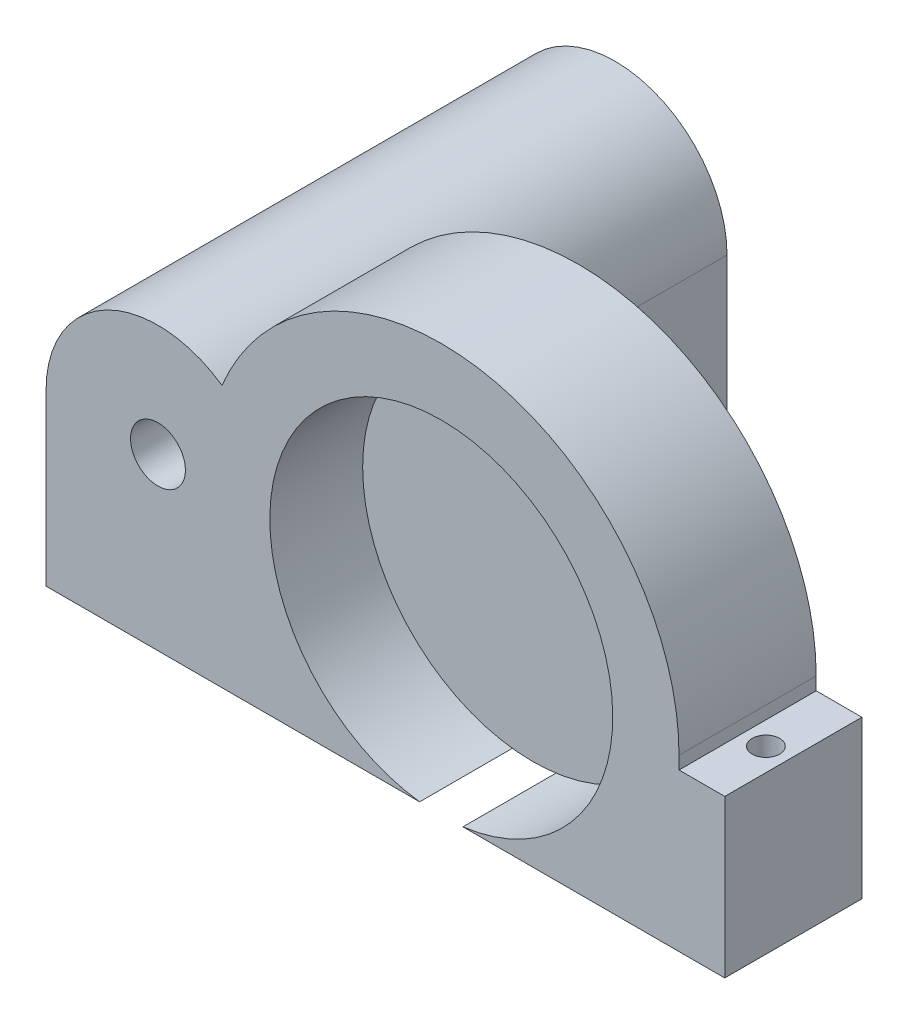
ISO-10303-21;
HEADER;
FILE_DESCRIPTION(('STEP AP214'),'2;1');
FILE_NAME('part.step','',(''),(''),'','','');
FILE_SCHEMA(('AUTOMOTIVE_DESIGN { 1 0 10303 214 1 1 1 1 }'));
ENDSEC;
DATA;
#1=APPLICATION_CONTEXT('core data for automotive mechanical design processes');
#2=APPLICATION_PROTOCOL_DEFINITION('international standard','automotive_design',2000,#1);
#3=PRODUCT_CONTEXT('',#1,'mechanical');
#4=PRODUCT('Part','Part','',(#3));
#5=PRODUCT_RELATED_PRODUCT_CATEGORY('part','',(#4));
#6=PRODUCT_DEFINITION_FORMATION('','',#4);
#7=PRODUCT_DEFINITION_CONTEXT('part definition',#1,'design');
#8=PRODUCT_DEFINITION('design','',#6,#7);
#9=PRODUCT_DEFINITION_SHAPE('','',#8);
#10=(LENGTH_UNIT() NAMED_UNIT(*) SI_UNIT(.MILLI.,.METRE.));
#11=(NAMED_UNIT(*) PLANE_ANGLE_UNIT() SI_UNIT($,.RADIAN.));
#12=(NAMED_UNIT(*) SI_UNIT($,.STERADIAN.) SOLID_ANGLE_UNIT());
#13=UNCERTAINTY_MEASURE_WITH_UNIT(LENGTH_MEASURE(1.E-05),#10,'distance_accuracy_value','');
#14=(GEOMETRIC_REPRESENTATION_CONTEXT(3) GLOBAL_UNCERTAINTY_ASSIGNED_CONTEXT((#13)) GLOBAL_UNIT_ASSIGNED_CONTEXT((#10,
#11,#12)) REPRESENTATION_CONTEXT('',''));
#15=CARTESIAN_POINT('',(0.,0.,0.));
#16=DIRECTION('',(0.,0.,1.));
#17=DIRECTION('',(1.,0.,0.));
#18=AXIS2_PLACEMENT_3D('',#15,#16,#17);
#19=CARTESIAN_POINT('',(0.,0.,0.));
#20=DIRECTION('',(0.,0.,1.));
#21=DIRECTION('',(1.,0.,0.));
#22=AXIS2_PLACEMENT_3D('',#19,#20,#21);
#23=PLANE('',#22);
#24=CARTESIAN_POINT('',(0.,0.,0.));
#25=DIRECTION('',(0.,0.,1.));
#26=DIRECTION('',(1.,0.,0.));
#27=AXIS2_PLACEMENT_3D('',#24,#25,#26);
#28=CIRCLE('',#27,18.75);
#29=CARTESIAN_POINT('',(2.36696007570894,-18.6,0.));
#30=VERTEX_POINT('',#29);
#31=CARTESIAN_POINT('',(-18.75,0.,0.));
#32=VERTEX_POINT('',#31);
#33=EDGE_CURVE('E156',#30,#32,#28,.T.);
#34=ORIENTED_EDGE('',*,*,#33,.T.);
#35=CARTESIAN_POINT('',(-30.9847959940793,0.,0.));
#36=DIRECTION('',(0.,0.,1.));
#37=DIRECTION('',(1.,0.,0.));
#38=AXIS2_PLACEMENT_3D('',#35,#36,#37);
#39=CIRCLE('',#38,12.2347959940793);
#40=CARTESIAN_POINT('',(-23.9854306296223,10.0348949925536,0.));
#41=VERTEX_POINT('',#40);
#42=EDGE_CURVE('E12',#32,#41,#39,.T.);
#43=ORIENTED_EDGE('',*,*,#42,.T.);
#44=CARTESIAN_POINT('',(0.,0.,0.));
#45=DIRECTION('',(0.,0.,1.));
#46=DIRECTION('',(1.,0.,0.));
#47=AXIS2_PLACEMENT_3D('',#44,#45,#46);
#48=CIRCLE('',#47,26.);
#49=CARTESIAN_POINT('',(26.,0.,0.));
#50=VERTEX_POINT('',#49);
#51=EDGE_CURVE('E99',#41,#50,#48,.F.);
#52=ORIENTED_EDGE('',*,*,#51,.T.);
#53=DIRECTION('',(0.,-1.,0.));
#54=VECTOR('',#53,1.);
#55=CARTESIAN_POINT('',(26.,0.,0.));
#56=LINE('',#55,#54);
#57=CARTESIAN_POINT('',(26.,-1.40113329018293,0.));
#58=VERTEX_POINT('',#57);
#59=EDGE_CURVE('E162',#50,#58,#56,.T.);
#60=ORIENTED_EDGE('',*,*,#59,.T.);
#61=DIRECTION('',(1.,0.,0.));
#62=VECTOR('',#61,1.);
#63=CARTESIAN_POINT('',(0.,-1.40113329018292,0.));
#64=LINE('',#63,#62);
#65=CARTESIAN_POINT('',(31.,-1.40113329018293,0.));
#66=VERTEX_POINT('',#65);
#67=EDGE_CURVE('E160',#58,#66,#64,.T.);
#68=ORIENTED_EDGE('',*,*,#67,.T.);
#69=DIRECTION('',(0.,-1.,0.));
#70=VECTOR('',#69,1.);
#71=CARTESIAN_POINT('',(31.,0.,0.));
#72=LINE('',#71,#70);
#73=CARTESIAN_POINT('',(31.,-18.6,0.));
#74=VERTEX_POINT('',#73);
#75=EDGE_CURVE('E125',#66,#74,#72,.T.);
#76=ORIENTED_EDGE('',*,*,#75,.T.);
#77=DIRECTION('',(1.,0.,0.));
#78=VECTOR('',#77,1.);
#79=CARTESIAN_POINT('',(0.,-18.6,0.));
#80=LINE('',#79,#78);
#81=EDGE_CURVE('E155',#30,#74,#80,.T.);
#82=ORIENTED_EDGE('',*,*,#81,.F.);
#83=EDGE_LOOP('',(#34,#43,#52,#60,#68,#76,#82));
#84=FACE_BOUND('',#83,.T.);
#85=ADVANCED_FACE('F47',(#84),#23,.F.);
#86=CARTESIAN_POINT('',(0.,0.,15.));
#87=DIRECTION('',(0.,0.,-1.));
#88=DIRECTION('',(-1.,0.,0.));
#89=AXIS2_PLACEMENT_3D('',#86,#87,#88);
#90=CYLINDRICAL_SURFACE('',#89,26.);
#91=DIRECTION('',(0.,0.,-1.));
#92=VECTOR('',#91,1.);
#93=CARTESIAN_POINT('',(-23.9854306296223,10.0348949925536,-10.));
#94=LINE('',#93,#92);
#95=CARTESIAN_POINT('',(-23.9854306296223,10.0348949925536,15.));
#96=VERTEX_POINT('',#95);
#97=EDGE_CURVE('E174',#96,#41,#94,.T.);
#98=ORIENTED_EDGE('',*,*,#97,.F.);
#99=CARTESIAN_POINT('',(0.,0.,15.));
#100=DIRECTION('',(0.,0.,1.));
#101=DIRECTION('',(1.,0.,0.));
#102=AXIS2_PLACEMENT_3D('',#99,#100,#101);
#103=CIRCLE('',#102,26.);
#104=CARTESIAN_POINT('',(26.,0.,15.));
#105=VERTEX_POINT('',#104);
#106=EDGE_CURVE('E71',#96,#105,#103,.F.);
#107=ORIENTED_EDGE('',*,*,#106,.T.);
#108=DIRECTION('',(0.,0.,-1.));
#109=VECTOR('',#108,1.);
#110=CARTESIAN_POINT('',(26.,0.,15.));
#111=LINE('',#110,#109);
#112=EDGE_CURVE('E146',#105,#50,#111,.T.);
#113=ORIENTED_EDGE('',*,*,#112,.T.);
#114=ORIENTED_EDGE('',*,*,#51,.F.);
#115=EDGE_LOOP('',(#98,#107,#113,#114));
#116=FACE_BOUND('',#115,.T.);
#117=ADVANCED_FACE('F49',(#116),#90,.T.);
#118=CARTESIAN_POINT('',(0.,-18.6,15.));
#119=DIRECTION('',(0.,1.,0.));
#120=DIRECTION('',(0.,0.,1.));
#121=AXIS2_PLACEMENT_3D('',#118,#119,#120);
#122=PLANE('',#121);
#123=DIRECTION('',(0.,0.,-1.));
#124=VECTOR('',#123,1.);
#125=CARTESIAN_POINT('',(-2.36696007570894,-18.6,15.));
#126=LINE('',#125,#124);
#127=CARTESIAN_POINT('',(-2.36696007570894,-18.6,15.));
#128=VERTEX_POINT('',#127);
#129=CARTESIAN_POINT('',(-2.36696007570894,-18.6,0.));
#130=VERTEX_POINT('',#129);
#131=EDGE_CURVE('E169',#128,#130,#126,.T.);
#132=ORIENTED_EDGE('',*,*,#131,.F.);
#133=DIRECTION('',(1.,0.,0.));
#134=VECTOR('',#133,1.);
#135=CARTESIAN_POINT('',(0.,-18.6,15.));
#136=LINE('',#135,#134);
#137=CARTESIAN_POINT('',(-43.2195919881586,-18.6,15.));
#138=VERTEX_POINT('',#137);
#139=EDGE_CURVE('E107',#138,#128,#136,.T.);
#140=ORIENTED_EDGE('',*,*,#139,.F.);
#141=DIRECTION('',(0.,0.,-1.));
#142=VECTOR('',#141,1.);
#143=CARTESIAN_POINT('',(-43.2195919881586,-18.6,15.));
#144=LINE('',#143,#142);
#145=CARTESIAN_POINT('',(-43.2195919881586,-18.6,-35.));
#146=VERTEX_POINT('',#145);
#147=EDGE_CURVE('E205',#138,#146,#144,.T.);
#148=ORIENTED_EDGE('',*,*,#147,.T.);
#149=DIRECTION('',(1.,0.,0.));
#150=VECTOR('',#149,1.);
#151=CARTESIAN_POINT('',(0.,-18.6,-35.));
#152=LINE('',#151,#150);
#153=CARTESIAN_POINT('',(-18.75,-18.6,-35.));
#154=VERTEX_POINT('',#153);
#155=EDGE_CURVE('E201',#146,#154,#152,.T.);
#156=ORIENTED_EDGE('',*,*,#155,.T.);
#157=DIRECTION('',(0.,0.,-1.));
#158=VECTOR('',#157,1.);
#159=CARTESIAN_POINT('',(-18.75,-18.6,15.));
#160=LINE('',#159,#158);
#161=CARTESIAN_POINT('',(-18.75,-18.6,0.));
#162=VERTEX_POINT('',#161);
#163=EDGE_CURVE('E198',#162,#154,#160,.T.);
#164=ORIENTED_EDGE('',*,*,#163,.F.);
#165=EDGE_CURVE('E151',#162,#130,#80,.T.);
#166=ORIENTED_EDGE('',*,*,#165,.T.);
#167=EDGE_LOOP('',(#132,#140,#148,#156,#164,#166));
#168=FACE_BOUND('',#167,.T.);
#169=ADVANCED_FACE('F194',(#168),#122,.F.);
#170=CARTESIAN_POINT('',(0.,0.,15.));
#171=DIRECTION('',(0.,0.,-1.));
#172=DIRECTION('',(-1.,0.,0.));
#173=AXIS2_PLACEMENT_3D('',#170,#171,#172);
#174=CYLINDRICAL_SURFACE('',#173,18.75);
#175=EDGE_CURVE('E154',#32,#130,#28,.T.);
#176=ORIENTED_EDGE('',*,*,#175,.F.);
#177=ORIENTED_EDGE('',*,*,#33,.F.);
#178=DIRECTION('',(0.,0.,-1.));
#179=VECTOR('',#178,1.);
#180=CARTESIAN_POINT('',(2.36696007570894,-18.6,15.));
#181=LINE('',#180,#179);
#182=CARTESIAN_POINT('',(2.36696007570894,-18.6,15.));
#183=VERTEX_POINT('',#182);
#184=EDGE_CURVE('E167',#183,#30,#181,.T.);
#185=ORIENTED_EDGE('',*,*,#184,.F.);
#186=CARTESIAN_POINT('',(0.,0.,15.));
#187=DIRECTION('',(0.,0.,1.));
#188=DIRECTION('',(1.,0.,0.));
#189=AXIS2_PLACEMENT_3D('',#186,#187,#188);
#190=CIRCLE('',#189,18.75);
#191=EDGE_CURVE('E192',#183,#128,#190,.T.);
#192=ORIENTED_EDGE('',*,*,#191,.T.);
#193=ORIENTED_EDGE('',*,*,#131,.T.);
#194=EDGE_LOOP('',(#176,#177,#185,#192,#193));
#195=FACE_BOUND('',#194,.T.);
#196=ADVANCED_FACE('F186',(#195),#174,.F.);
#197=CARTESIAN_POINT('',(28.5,-18.6,8.));
#198=DIRECTION('',(0.,1.,0.));
#199=DIRECTION('',(0.,0.,1.));
#200=AXIS2_PLACEMENT_3D('',#197,#198,#199);
#201=CIRCLE('',#200,1.5);
#202=CARTESIAN_POINT('',(28.5,-18.6,9.5));
#203=VERTEX_POINT('',#202);
#204=EDGE_CURVE('E152',#203,#203,#201,.T.);
#205=ORIENTED_EDGE('',*,*,#204,.T.);
#206=EDGE_LOOP('',(#205));
#207=FACE_BOUND('',#206,.T.);
#208=ORIENTED_EDGE('',*,*,#81,.T.);
#209=DIRECTION('',(0.,0.,-1.));
#210=VECTOR('',#209,1.);
#211=CARTESIAN_POINT('',(31.,-18.6,15.));
#212=LINE('',#211,#210);
#213=CARTESIAN_POINT('',(31.,-18.6,15.));
#214=VERTEX_POINT('',#213);
#215=EDGE_CURVE('E130',#214,#74,#212,.T.);
#216=ORIENTED_EDGE('',*,*,#215,.F.);
#217=EDGE_CURVE('E140',#183,#214,#136,.T.);
#218=ORIENTED_EDGE('',*,*,#217,.F.);
#219=ORIENTED_EDGE('',*,*,#184,.T.);
#220=EDGE_LOOP('',(#208,#216,#218,#219));
#221=FACE_BOUND('',#220,.T.);
#222=ADVANCED_FACE('F191',(#207,#221),#122,.F.);
#223=CARTESIAN_POINT('',(31.,0.,15.));
#224=DIRECTION('',(1.,0.,0.));
#225=DIRECTION('',(0.,1.,0.));
#226=AXIS2_PLACEMENT_3D('',#223,#224,#225);
#227=PLANE('',#226);
#228=ORIENTED_EDGE('',*,*,#75,.F.);
#229=DIRECTION('',(0.,0.,-1.));
#230=VECTOR('',#229,1.);
#231=CARTESIAN_POINT('',(31.,-1.40113329018293,15.));
#232=LINE('',#231,#230);
#233=CARTESIAN_POINT('',(31.,-1.40113329018293,15.));
#234=VERTEX_POINT('',#233);
#235=EDGE_CURVE('E120',#234,#66,#232,.T.);
#236=ORIENTED_EDGE('',*,*,#235,.F.);
#237=DIRECTION('',(0.,-1.,0.));
#238=VECTOR('',#237,1.);
#239=CARTESIAN_POINT('',(31.,0.,15.));
#240=LINE('',#239,#238);
#241=EDGE_CURVE('E123',#234,#214,#240,.T.);
#242=ORIENTED_EDGE('',*,*,#241,.T.);
#243=ORIENTED_EDGE('',*,*,#215,.T.);
#244=EDGE_LOOP('',(#228,#236,#242,#243));
#245=FACE_BOUND('',#244,.T.);
#246=ADVANCED_FACE('F122',(#245),#227,.T.);
#247=CARTESIAN_POINT('',(0.,-1.40113329018292,15.));
#248=DIRECTION('',(0.,1.,0.));
#249=DIRECTION('',(-1.,0.,0.));
#250=AXIS2_PLACEMENT_3D('',#247,#248,#249);
#251=PLANE('',#250);
#252=CARTESIAN_POINT('',(28.5,-1.40113329018293,8.));
#253=DIRECTION('',(0.,1.,0.));
#254=DIRECTION('',(-1.,0.,0.));
#255=AXIS2_PLACEMENT_3D('',#252,#253,#254);
#256=CIRCLE('',#255,1.5);
#257=CARTESIAN_POINT('',(27.,-1.40113329018293,8.));
#258=VERTEX_POINT('',#257);
#259=EDGE_CURVE('E172',#258,#258,#256,.T.);
#260=ORIENTED_EDGE('',*,*,#259,.F.);
#261=EDGE_LOOP('',(#260));
#262=FACE_BOUND('',#261,.T.);
#263=ORIENTED_EDGE('',*,*,#67,.F.);
#264=DIRECTION('',(0.,0.,-1.));
#265=VECTOR('',#264,1.);
#266=CARTESIAN_POINT('',(26.,-1.40113329018293,15.));
#267=LINE('',#266,#265);
#268=CARTESIAN_POINT('',(26.,-1.40113329018293,15.));
#269=VERTEX_POINT('',#268);
#270=EDGE_CURVE('E131',#269,#58,#267,.T.);
#271=ORIENTED_EDGE('',*,*,#270,.F.);
#272=DIRECTION('',(1.,0.,0.));
#273=VECTOR('',#272,1.);
#274=CARTESIAN_POINT('',(0.,-1.40113329018292,15.));
#275=LINE('',#274,#273);
#276=EDGE_CURVE('E137',#269,#234,#275,.T.);
#277=ORIENTED_EDGE('',*,*,#276,.T.);
#278=ORIENTED_EDGE('',*,*,#235,.T.);
#279=EDGE_LOOP('',(#263,#271,#277,#278));
#280=FACE_BOUND('',#279,.T.);
#281=ADVANCED_FACE('F143',(#262,#280),#251,.T.);
#282=CARTESIAN_POINT('',(26.,0.,15.));
#283=DIRECTION('',(1.,0.,0.));
#284=DIRECTION('',(0.,0.,-1.));
#285=AXIS2_PLACEMENT_3D('',#282,#283,#284);
#286=PLANE('',#285);
#287=ORIENTED_EDGE('',*,*,#59,.F.);
#288=ORIENTED_EDGE('',*,*,#112,.F.);
#289=DIRECTION('',(0.,-1.,0.));
#290=VECTOR('',#289,1.);
#291=CARTESIAN_POINT('',(26.,0.,15.));
#292=LINE('',#291,#290);
#293=EDGE_CURVE('E144',#105,#269,#292,.T.);
#294=ORIENTED_EDGE('',*,*,#293,.T.);
#295=ORIENTED_EDGE('',*,*,#270,.T.);
#296=EDGE_LOOP('',(#287,#288,#294,#295));
#297=FACE_BOUND('',#296,.T.);
#298=ADVANCED_FACE('F242',(#297),#286,.T.);
#299=CARTESIAN_POINT('',(0.,0.,15.));
#300=DIRECTION('',(0.,0.,1.));
#301=DIRECTION('',(1.,0.,0.));
#302=AXIS2_PLACEMENT_3D('',#299,#300,#301);
#303=PLANE('',#302);
#304=ORIENTED_EDGE('',*,*,#106,.F.);
#305=CARTESIAN_POINT('',(-30.9847959940793,0.,15.));
#306=DIRECTION('',(0.,0.,1.));
#307=DIRECTION('',(1.,0.,0.));
#308=AXIS2_PLACEMENT_3D('',#305,#306,#307);
#309=CIRCLE('',#308,12.2347959940793);
#310=CARTESIAN_POINT('',(-43.2195919881586,0.,15.));
#311=VERTEX_POINT('',#310);
#312=EDGE_CURVE('E367',#311,#96,#309,.F.);
#313=ORIENTED_EDGE('',*,*,#312,.F.);
#314=DIRECTION('',(0.,-1.,0.));
#315=VECTOR('',#314,1.);
#316=CARTESIAN_POINT('',(-43.2195919881586,0.,15.));
#317=LINE('',#316,#315);
#318=EDGE_CURVE('E370',#311,#138,#317,.T.);
#319=ORIENTED_EDGE('',*,*,#318,.T.);
#320=ORIENTED_EDGE('',*,*,#139,.T.);
#321=ORIENTED_EDGE('',*,*,#191,.F.);
#322=ORIENTED_EDGE('',*,*,#217,.T.);
#323=ORIENTED_EDGE('',*,*,#241,.F.);
#324=ORIENTED_EDGE('',*,*,#276,.F.);
#325=ORIENTED_EDGE('',*,*,#293,.F.);
#326=EDGE_LOOP('',(#304,#313,#319,#320,#321,#322,#323,#324,#325));
#327=FACE_BOUND('',#326,.T.);
#328=CARTESIAN_POINT('',(-30.9847959940793,0.,15.));
#329=DIRECTION('',(0.,0.,1.));
#330=DIRECTION('',(1.,0.,0.));
#331=AXIS2_PLACEMENT_3D('',#328,#329,#330);
#332=CIRCLE('',#331,3.);
#333=CARTESIAN_POINT('',(-27.9847959940793,0.,15.));
#334=VERTEX_POINT('',#333);
#335=EDGE_CURVE('E209',#334,#334,#332,.T.);
#336=ORIENTED_EDGE('',*,*,#335,.F.);
#337=EDGE_LOOP('',(#336));
#338=FACE_BOUND('',#337,.T.);
#339=ADVANCED_FACE('F134',(#327,#338),#303,.T.);
#340=ORIENTED_EDGE('',*,*,#165,.F.);
#341=DIRECTION('',(0.,1.,0.));
#342=VECTOR('',#341,1.);
#343=CARTESIAN_POINT('',(-18.75,0.,0.));
#344=LINE('',#343,#342);
#345=EDGE_CURVE('E55',#162,#32,#344,.T.);
#346=ORIENTED_EDGE('',*,*,#345,.T.);
#347=ORIENTED_EDGE('',*,*,#175,.T.);
#348=EDGE_LOOP('',(#340,#346,#347));
#349=FACE_BOUND('',#348,.T.);
#350=ADVANCED_FACE('F180',(#349),#23,.F.);
#351=CARTESIAN_POINT('',(28.5,-20.,8.));
#352=DIRECTION('',(0.,1.,0.));
#353=DIRECTION('',(0.,0.,1.));
#354=AXIS2_PLACEMENT_3D('',#351,#352,#353);
#355=CYLINDRICAL_SURFACE('',#354,1.5);
#356=ORIENTED_EDGE('',*,*,#259,.T.);
#357=EDGE_LOOP('',(#356));
#358=FACE_BOUND('',#357,.T.);
#359=ORIENTED_EDGE('',*,*,#204,.F.);
#360=EDGE_LOOP('',(#359));
#361=FACE_BOUND('',#360,.T.);
#362=ADVANCED_FACE('F223',(#358,#361),#355,.F.);
#363=CARTESIAN_POINT('',(-18.75,0.,15.));
#364=DIRECTION('',(1.,0.,0.));
#365=DIRECTION('',(0.,1.,0.));
#366=AXIS2_PLACEMENT_3D('',#363,#364,#365);
#367=PLANE('',#366);
#368=ORIENTED_EDGE('',*,*,#345,.F.);
#369=ORIENTED_EDGE('',*,*,#163,.T.);
#370=DIRECTION('',(0.,-1.,0.));
#371=VECTOR('',#370,1.);
#372=CARTESIAN_POINT('',(-18.75,0.,-35.));
#373=LINE('',#372,#371);
#374=CARTESIAN_POINT('',(-18.75,0.,-35.));
#375=VERTEX_POINT('',#374);
#376=EDGE_CURVE('E368',#375,#154,#373,.T.);
#377=ORIENTED_EDGE('',*,*,#376,.F.);
#378=DIRECTION('',(0.,0.,-1.));
#379=VECTOR('',#378,1.);
#380=CARTESIAN_POINT('',(-18.75,0.,15.));
#381=LINE('',#380,#379);
#382=EDGE_CURVE('E62',#32,#375,#381,.T.);
#383=ORIENTED_EDGE('',*,*,#382,.F.);
#384=EDGE_LOOP('',(#368,#369,#377,#383));
#385=FACE_BOUND('',#384,.T.);
#386=ADVANCED_FACE('F225',(#385),#367,.T.);
#387=CARTESIAN_POINT('',(-30.9847959940793,0.,15.));
#388=DIRECTION('',(0.,0.,-1.));
#389=DIRECTION('',(-1.,0.,0.));
#390=AXIS2_PLACEMENT_3D('',#387,#388,#389);
#391=CYLINDRICAL_SURFACE('',#390,12.2347959940793);
#392=ORIENTED_EDGE('',*,*,#312,.T.);
#393=ORIENTED_EDGE('',*,*,#97,.T.);
#394=ORIENTED_EDGE('',*,*,#42,.F.);
#395=ORIENTED_EDGE('',*,*,#382,.T.);
#396=CARTESIAN_POINT('',(-30.9847959940793,0.,-35.));
#397=DIRECTION('',(0.,0.,1.));
#398=DIRECTION('',(1.,0.,0.));
#399=AXIS2_PLACEMENT_3D('',#396,#397,#398);
#400=CIRCLE('',#399,12.2347959940793);
#401=CARTESIAN_POINT('',(-43.2195919881586,0.,-35.));
#402=VERTEX_POINT('',#401);
#403=EDGE_CURVE('E362',#402,#375,#400,.F.);
#404=ORIENTED_EDGE('',*,*,#403,.F.);
#405=DIRECTION('',(0.,0.,-1.));
#406=VECTOR('',#405,1.);
#407=CARTESIAN_POINT('',(-43.2195919881586,0.,15.));
#408=LINE('',#407,#406);
#409=EDGE_CURVE('E207',#311,#402,#408,.T.);
#410=ORIENTED_EDGE('',*,*,#409,.F.);
#411=EDGE_LOOP('',(#392,#393,#394,#395,#404,#410));
#412=FACE_BOUND('',#411,.T.);
#413=ADVANCED_FACE('F232',(#412),#391,.T.);
#414=CARTESIAN_POINT('',(-43.2195919881586,0.,15.));
#415=DIRECTION('',(1.,0.,0.));
#416=DIRECTION('',(0.,1.,0.));
#417=AXIS2_PLACEMENT_3D('',#414,#415,#416);
#418=PLANE('',#417);
#419=DIRECTION('',(0.,-1.,0.));
#420=VECTOR('',#419,1.);
#421=CARTESIAN_POINT('',(-43.2195919881586,0.,-35.));
#422=LINE('',#421,#420);
#423=EDGE_CURVE('E375',#402,#146,#422,.T.);
#424=ORIENTED_EDGE('',*,*,#423,.T.);
#425=ORIENTED_EDGE('',*,*,#147,.F.);
#426=ORIENTED_EDGE('',*,*,#318,.F.);
#427=ORIENTED_EDGE('',*,*,#409,.T.);
#428=EDGE_LOOP('',(#424,#425,#426,#427));
#429=FACE_BOUND('',#428,.T.);
#430=ADVANCED_FACE('F324',(#429),#418,.F.);
#431=CARTESIAN_POINT('',(-30.9847959940793,0.,15.));
#432=DIRECTION('',(0.,0.,-1.));
#433=DIRECTION('',(-1.,0.,0.));
#434=AXIS2_PLACEMENT_3D('',#431,#432,#433);
#435=CYLINDRICAL_SURFACE('',#434,3.);
#436=ORIENTED_EDGE('',*,*,#335,.T.);
#437=EDGE_LOOP('',(#436));
#438=FACE_BOUND('',#437,.T.);
#439=CARTESIAN_POINT('',(-30.9847959940793,0.,-35.));
#440=DIRECTION('',(0.,0.,1.));
#441=DIRECTION('',(1.,0.,0.));
#442=AXIS2_PLACEMENT_3D('',#439,#440,#441);
#443=CIRCLE('',#442,3.);
#444=CARTESIAN_POINT('',(-27.9847959940793,0.,-35.));
#445=VERTEX_POINT('',#444);
#446=EDGE_CURVE('E365',#445,#445,#443,.T.);
#447=ORIENTED_EDGE('',*,*,#446,.F.);
#448=EDGE_LOOP('',(#447));
#449=FACE_BOUND('',#448,.T.);
#450=ADVANCED_FACE('F333',(#438,#449),#435,.F.);
#451=CARTESIAN_POINT('',(0.,0.,-35.));
#452=DIRECTION('',(0.,0.,1.));
#453=DIRECTION('',(1.,0.,0.));
#454=AXIS2_PLACEMENT_3D('',#451,#452,#453);
#455=PLANE('',#454);
#456=ORIENTED_EDGE('',*,*,#403,.T.);
#457=ORIENTED_EDGE('',*,*,#376,.T.);
#458=ORIENTED_EDGE('',*,*,#155,.F.);
#459=ORIENTED_EDGE('',*,*,#423,.F.);
#460=EDGE_LOOP('',(#456,#457,#458,#459));
#461=FACE_BOUND('',#460,.T.);
#462=ORIENTED_EDGE('',*,*,#446,.T.);
#463=EDGE_LOOP('',(#462));
#464=FACE_BOUND('',#463,.T.);
#465=ADVANCED_FACE('F343',(#461,#464),#455,.F.);
#466=CLOSED_SHELL('',(#85,#117,#169,#196,#222,#246,#281,#298,#339,#350,#362,#386,#413,#430,#450,#465));
#467=MANIFOLD_SOLID_BREP('B2',#466);
#468=CARTESIAN_POINT('',(0.,0.,5.));
#469=DIRECTION('',(0.,0.,-1.));
#470=DIRECTION('',(-1.,0.,0.));
#471=AXIS2_PLACEMENT_3D('',#468,#469,#470);
#472=CYLINDRICAL_SURFACE('',#471,18.6);
#473=CARTESIAN_POINT('',(0.,0.,5.));
#474=DIRECTION('',(0.,0.,1.));
#475=DIRECTION('',(1.,0.,0.));
#476=AXIS2_PLACEMENT_3D('',#473,#474,#475);
#477=CIRCLE('',#476,18.6);
#478=CARTESIAN_POINT('',(18.6,0.,5.));
#479=VERTEX_POINT('',#478);
#480=EDGE_CURVE('E46',#479,#479,#477,.T.);
#481=ORIENTED_EDGE('',*,*,#480,.F.);
#482=EDGE_LOOP('',(#481));
#483=FACE_BOUND('',#482,.T.);
#484=CARTESIAN_POINT('',(0.,0.,0.));
#485=DIRECTION('',(0.,0.,1.));
#486=DIRECTION('',(1.,0.,0.));
#487=AXIS2_PLACEMENT_3D('',#484,#485,#486);
#488=CIRCLE('',#487,18.6);
#489=CARTESIAN_POINT('',(18.6,0.,0.));
#490=VERTEX_POINT('',#489);
#491=EDGE_CURVE('E419',#490,#490,#488,.T.);
#492=ORIENTED_EDGE('',*,*,#491,.T.);
#493=EDGE_LOOP('',(#492));
#494=FACE_BOUND('',#493,.T.);
#495=ADVANCED_FACE('F416',(#483,#494),#472,.T.);
#496=CARTESIAN_POINT('',(0.,0.,5.));
#497=DIRECTION('',(0.,0.,1.));
#498=DIRECTION('',(1.,0.,0.));
#499=AXIS2_PLACEMENT_3D('',#496,#497,#498);
#500=PLANE('',#499);
#501=ORIENTED_EDGE('',*,*,#480,.T.);
#502=EDGE_LOOP('',(#501));
#503=FACE_BOUND('',#502,.T.);
#504=ADVANCED_FACE('F431',(#503),#500,.T.);
#505=CARTESIAN_POINT('',(0.,0.,0.));
#506=DIRECTION('',(0.,0.,1.));
#507=DIRECTION('',(1.,0.,0.));
#508=AXIS2_PLACEMENT_3D('',#505,#506,#507);
#509=PLANE('',#508);
#510=ORIENTED_EDGE('',*,*,#491,.F.);
#511=EDGE_LOOP('',(#510));
#512=FACE_BOUND('',#511,.T.);
#513=ADVANCED_FACE('F429',(#512),#509,.F.);
#514=CLOSED_SHELL('',(#495,#504,#513));
#515=MANIFOLD_SOLID_BREP('B6',#514);
#516=ADVANCED_BREP_SHAPE_REPRESENTATION('',(#18,#467,#515),#14);
#517=SHAPE_DEFINITION_REPRESENTATION(#9,#516);
ENDSEC;
END-ISO-10303-21;
